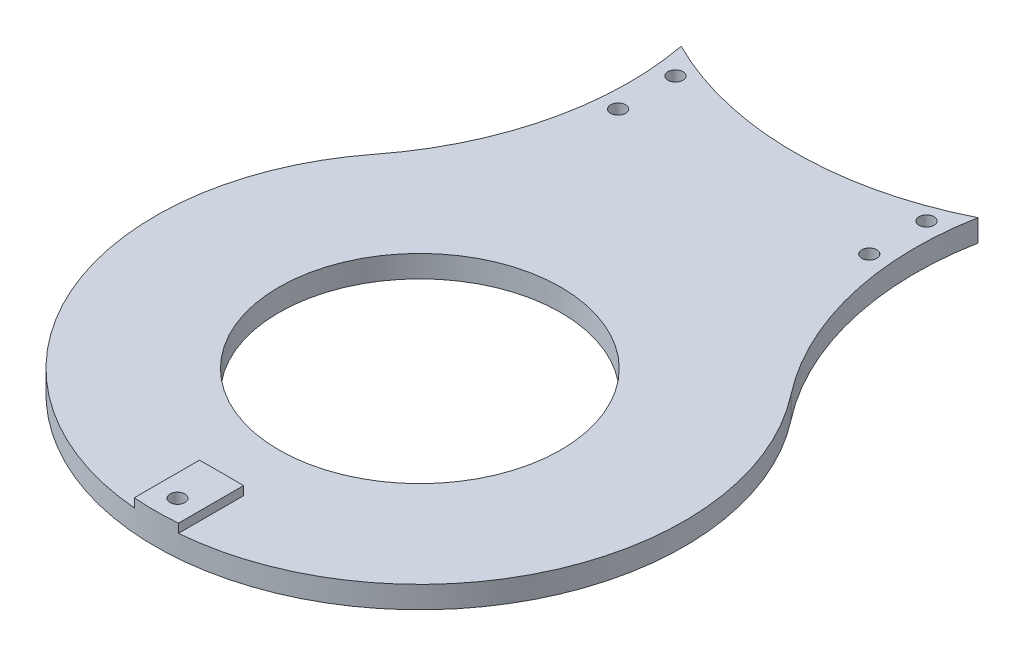
ISO-10303-21;
HEADER;
FILE_DESCRIPTION(('STEP AP214'),'2;1');
FILE_NAME('part.step','',(''),(''),'','','');
FILE_SCHEMA(('AUTOMOTIVE_DESIGN { 1 0 10303 214 1 1 1 1 }'));
ENDSEC;
DATA;
#1=APPLICATION_CONTEXT('core data for automotive mechanical design processes');
#2=APPLICATION_PROTOCOL_DEFINITION('international standard','automotive_design',2000,#1);
#3=PRODUCT_CONTEXT('',#1,'mechanical');
#4=PRODUCT('Part','Part','',(#3));
#5=PRODUCT_RELATED_PRODUCT_CATEGORY('part','',(#4));
#6=PRODUCT_DEFINITION_FORMATION('','',#4);
#7=PRODUCT_DEFINITION_CONTEXT('part definition',#1,'design');
#8=PRODUCT_DEFINITION('design','',#6,#7);
#9=PRODUCT_DEFINITION_SHAPE('','',#8);
#10=(LENGTH_UNIT() NAMED_UNIT(*) SI_UNIT(.MILLI.,.METRE.));
#11=(NAMED_UNIT(*) PLANE_ANGLE_UNIT() SI_UNIT($,.RADIAN.));
#12=(NAMED_UNIT(*) SI_UNIT($,.STERADIAN.) SOLID_ANGLE_UNIT());
#13=UNCERTAINTY_MEASURE_WITH_UNIT(LENGTH_MEASURE(1.E-05),#10,'distance_accuracy_value','');
#14=(GEOMETRIC_REPRESENTATION_CONTEXT(3) GLOBAL_UNCERTAINTY_ASSIGNED_CONTEXT((#13)) GLOBAL_UNIT_ASSIGNED_CONTEXT((#10,
#11,#12)) REPRESENTATION_CONTEXT('',''));
#15=CARTESIAN_POINT('',(0.,0.,0.));
#16=DIRECTION('',(0.,0.,1.));
#17=DIRECTION('',(1.,0.,0.));
#18=AXIS2_PLACEMENT_3D('',#15,#16,#17);
#19=CARTESIAN_POINT('',(0.,-12.,55.));
#20=DIRECTION('',(0.,1.,0.));
#21=DIRECTION('',(0.,0.,1.));
#22=AXIS2_PLACEMENT_3D('',#19,#20,#21);
#23=CYLINDRICAL_SURFACE('',#22,1.7);
#24=CARTESIAN_POINT('',(0.,7.,55.));
#25=DIRECTION('',(0.,1.,0.));
#26=DIRECTION('',(0.,0.,1.));
#27=AXIS2_PLACEMENT_3D('',#24,#25,#26);
#28=CIRCLE('',#27,1.7);
#29=CARTESIAN_POINT('',(0.,7.,56.7));
#30=VERTEX_POINT('',#29);
#31=EDGE_CURVE('E138',#30,#30,#28,.T.);
#32=ORIENTED_EDGE('',*,*,#31,.T.);
#33=EDGE_LOOP('',(#32));
#34=FACE_BOUND('',#33,.T.);
#35=CARTESIAN_POINT('',(0.,3.,55.));
#36=DIRECTION('',(0.,-1.,0.));
#37=DIRECTION('',(0.,0.,-1.));
#38=AXIS2_PLACEMENT_3D('',#35,#36,#37);
#39=CIRCLE('',#38,1.7);
#40=CARTESIAN_POINT('',(0.,3.,53.3));
#41=VERTEX_POINT('',#40);
#42=EDGE_CURVE('E136',#41,#41,#39,.F.);
#43=ORIENTED_EDGE('',*,*,#42,.F.);
#44=EDGE_LOOP('',(#43));
#45=FACE_BOUND('',#44,.T.);
#46=ADVANCED_FACE('F36',(#34,#45),#23,.F.);
#47=CARTESIAN_POINT('',(51.234753829798,5.,-40.));
#48=DIRECTION('',(0.,1.,0.));
#49=DIRECTION('',(0.,0.,1.));
#50=AXIS2_PLACEMENT_3D('',#47,#48,#49);
#51=PLANE('',#50);
#52=CARTESIAN_POINT('',(0.,5.,-160.));
#53=DIRECTION('',(0.,1.,0.));
#54=DIRECTION('',(0.,0.,1.));
#55=AXIS2_PLACEMENT_3D('',#52,#53,#54);
#56=CIRCLE('',#55,75.);
#57=CARTESIAN_POINT('',(-33.6854203746086,5.,-92.9903555136583));
#58=VERTEX_POINT('',#57);
#59=CARTESIAN_POINT('',(33.6854203746086,5.,-92.9903555136583));
#60=VERTEX_POINT('',#59);
#61=EDGE_CURVE('E102',#58,#60,#56,.T.);
#62=ORIENTED_EDGE('',*,*,#61,.F.);
#63=CARTESIAN_POINT('',(-102.469507659596,5.,-80.));
#64=DIRECTION('',(0.,-1.,0.));
#65=DIRECTION('',(0.,0.,1.));
#66=AXIS2_PLACEMENT_3D('',#63,#64,#65);
#67=CIRCLE('',#66,70.);
#68=CARTESIAN_POINT('',(-47.2936189198135,5.,-36.9230769230769));
#69=VERTEX_POINT('',#68);
#70=EDGE_CURVE('E185',#58,#69,#67,.T.);
#71=ORIENTED_EDGE('',*,*,#70,.T.);
#72=CARTESIAN_POINT('',(0.,5.,0.));
#73=DIRECTION('',(0.,1.,0.));
#74=DIRECTION('',(0.,0.,1.));
#75=AXIS2_PLACEMENT_3D('',#72,#73,#74);
#76=CIRCLE('',#75,60.);
#77=CARTESIAN_POINT('',(-5.00000000000001,5.,59.791303715507));
#78=VERTEX_POINT('',#77);
#79=EDGE_CURVE('E129',#69,#78,#76,.T.);
#80=ORIENTED_EDGE('',*,*,#79,.T.);
#81=DIRECTION('',(0.,0.,1.));
#82=VECTOR('',#81,1.);
#83=CARTESIAN_POINT('',(-5.00000000000001,5.,45.));
#84=LINE('',#83,#82);
#85=CARTESIAN_POINT('',(-5.00000000000001,5.,45.));
#86=VERTEX_POINT('',#85);
#87=EDGE_CURVE('E143',#86,#78,#84,.T.);
#88=ORIENTED_EDGE('',*,*,#87,.F.);
#89=DIRECTION('',(-1.,0.,0.));
#90=VECTOR('',#89,1.);
#91=CARTESIAN_POINT('',(-5.00000000000001,5.,45.));
#92=LINE('',#91,#90);
#93=CARTESIAN_POINT('',(4.99999999999999,5.,45.));
#94=VERTEX_POINT('',#93);
#95=EDGE_CURVE('E58',#94,#86,#92,.T.);
#96=ORIENTED_EDGE('',*,*,#95,.F.);
#97=DIRECTION('',(0.,0.,-1.));
#98=VECTOR('',#97,1.);
#99=CARTESIAN_POINT('',(4.99999999999999,5.,45.));
#100=LINE('',#99,#98);
#101=CARTESIAN_POINT('',(4.99999999999999,5.,59.791303715507));
#102=VERTEX_POINT('',#101);
#103=EDGE_CURVE('E169',#102,#94,#100,.T.);
#104=ORIENTED_EDGE('',*,*,#103,.F.);
#105=CARTESIAN_POINT('',(47.2936189198135,5.,-36.9230769230769));
#106=VERTEX_POINT('',#105);
#107=EDGE_CURVE('E186',#102,#106,#76,.T.);
#108=ORIENTED_EDGE('',*,*,#107,.T.);
#109=CARTESIAN_POINT('',(102.469507659596,5.,-80.));
#110=DIRECTION('',(0.,-1.,0.));
#111=DIRECTION('',(0.,0.,1.));
#112=AXIS2_PLACEMENT_3D('',#109,#110,#111);
#113=CIRCLE('',#112,70.);
#114=EDGE_CURVE('E133',#106,#60,#113,.T.);
#115=ORIENTED_EDGE('',*,*,#114,.T.);
#116=EDGE_LOOP('',(#62,#71,#80,#88,#96,#104,#108,#115));
#117=FACE_BOUND('',#116,.T.);
#118=CARTESIAN_POINT('',(28.5,5.,-73.5));
#119=DIRECTION('',(0.,-1.,0.));
#120=DIRECTION('',(0.,0.,-1.));
#121=AXIS2_PLACEMENT_3D('',#118,#119,#120);
#122=CIRCLE('',#121,1.70000000000001);
#123=CARTESIAN_POINT('',(28.5,5.,-75.2));
#124=VERTEX_POINT('',#123);
#125=EDGE_CURVE('E400',#124,#124,#122,.T.);
#126=ORIENTED_EDGE('',*,*,#125,.T.);
#127=EDGE_LOOP('',(#126));
#128=FACE_BOUND('',#127,.T.);
#129=CARTESIAN_POINT('',(28.5,5.,-86.5));
#130=DIRECTION('',(0.,-1.,0.));
#131=DIRECTION('',(0.,0.,-1.));
#132=AXIS2_PLACEMENT_3D('',#129,#130,#131);
#133=CIRCLE('',#132,1.70000000000001);
#134=CARTESIAN_POINT('',(28.5,5.,-88.2));
#135=VERTEX_POINT('',#134);
#136=EDGE_CURVE('E393',#135,#135,#133,.T.);
#137=ORIENTED_EDGE('',*,*,#136,.T.);
#138=EDGE_LOOP('',(#137));
#139=FACE_BOUND('',#138,.T.);
#140=CARTESIAN_POINT('',(-28.5,5.,-86.5));
#141=DIRECTION('',(0.,-1.,0.));
#142=DIRECTION('',(0.,0.,-1.));
#143=AXIS2_PLACEMENT_3D('',#140,#141,#142);
#144=CIRCLE('',#143,1.70000000000001);
#145=CARTESIAN_POINT('',(-28.5,5.,-88.2));
#146=VERTEX_POINT('',#145);
#147=EDGE_CURVE('E392',#146,#146,#144,.T.);
#148=ORIENTED_EDGE('',*,*,#147,.T.);
#149=EDGE_LOOP('',(#148));
#150=FACE_BOUND('',#149,.T.);
#151=CARTESIAN_POINT('',(-28.5,5.,-73.5));
#152=DIRECTION('',(0.,-1.,0.));
#153=DIRECTION('',(0.,0.,-1.));
#154=AXIS2_PLACEMENT_3D('',#151,#152,#153);
#155=CIRCLE('',#154,1.70000000000001);
#156=CARTESIAN_POINT('',(-28.5,5.,-75.2));
#157=VERTEX_POINT('',#156);
#158=EDGE_CURVE('E151',#157,#157,#155,.T.);
#159=ORIENTED_EDGE('',*,*,#158,.T.);
#160=EDGE_LOOP('',(#159));
#161=FACE_BOUND('',#160,.T.);
#162=CARTESIAN_POINT('',(0.,5.,0.));
#163=DIRECTION('',(0.,1.,0.));
#164=DIRECTION('',(0.,0.,1.));
#165=AXIS2_PLACEMENT_3D('',#162,#163,#164);
#166=CIRCLE('',#165,32.);
#167=CARTESIAN_POINT('',(0.,5.,32.));
#168=VERTEX_POINT('',#167);
#169=EDGE_CURVE('E121',#168,#168,#166,.T.);
#170=ORIENTED_EDGE('',*,*,#169,.F.);
#171=EDGE_LOOP('',(#170));
#172=FACE_BOUND('',#171,.T.);
#173=ADVANCED_FACE('F190',(#117,#128,#139,#150,#161,#172),#51,.T.);
#174=CARTESIAN_POINT('',(51.234753829798,0.,-40.));
#175=DIRECTION('',(0.,1.,0.));
#176=DIRECTION('',(0.,0.,1.));
#177=AXIS2_PLACEMENT_3D('',#174,#175,#176);
#178=PLANE('',#177);
#179=CARTESIAN_POINT('',(28.5,0.,-73.5));
#180=DIRECTION('',(0.,-1.,0.));
#181=DIRECTION('',(0.,0.,-1.));
#182=AXIS2_PLACEMENT_3D('',#179,#180,#181);
#183=CIRCLE('',#182,1.70000000000001);
#184=CARTESIAN_POINT('',(28.5,0.,-75.2));
#185=VERTEX_POINT('',#184);
#186=EDGE_CURVE('E107',#185,#185,#183,.T.);
#187=ORIENTED_EDGE('',*,*,#186,.F.);
#188=EDGE_LOOP('',(#187));
#189=FACE_BOUND('',#188,.T.);
#190=CARTESIAN_POINT('',(28.5,0.,-86.5));
#191=DIRECTION('',(0.,-1.,0.));
#192=DIRECTION('',(0.,0.,-1.));
#193=AXIS2_PLACEMENT_3D('',#190,#191,#192);
#194=CIRCLE('',#193,1.70000000000001);
#195=CARTESIAN_POINT('',(28.5,0.,-88.2));
#196=VERTEX_POINT('',#195);
#197=EDGE_CURVE('E253',#196,#196,#194,.T.);
#198=ORIENTED_EDGE('',*,*,#197,.F.);
#199=EDGE_LOOP('',(#198));
#200=FACE_BOUND('',#199,.T.);
#201=CARTESIAN_POINT('',(-28.5,0.,-86.5));
#202=DIRECTION('',(0.,-1.,0.));
#203=DIRECTION('',(0.,0.,-1.));
#204=AXIS2_PLACEMENT_3D('',#201,#202,#203);
#205=CIRCLE('',#204,1.70000000000001);
#206=CARTESIAN_POINT('',(-28.5,0.,-88.2));
#207=VERTEX_POINT('',#206);
#208=EDGE_CURVE('E257',#207,#207,#205,.T.);
#209=ORIENTED_EDGE('',*,*,#208,.F.);
#210=EDGE_LOOP('',(#209));
#211=FACE_BOUND('',#210,.T.);
#212=CARTESIAN_POINT('',(-28.5,0.,-73.5));
#213=DIRECTION('',(0.,-1.,0.));
#214=DIRECTION('',(0.,0.,-1.));
#215=AXIS2_PLACEMENT_3D('',#212,#213,#214);
#216=CIRCLE('',#215,1.70000000000001);
#217=CARTESIAN_POINT('',(-28.5,0.,-75.2));
#218=VERTEX_POINT('',#217);
#219=EDGE_CURVE('E154',#218,#218,#216,.T.);
#220=ORIENTED_EDGE('',*,*,#219,.F.);
#221=EDGE_LOOP('',(#220));
#222=FACE_BOUND('',#221,.T.);
#223=CARTESIAN_POINT('',(0.,0.,55.));
#224=DIRECTION('',(0.,-1.,0.));
#225=DIRECTION('',(0.,0.,-1.));
#226=AXIS2_PLACEMENT_3D('',#223,#224,#225);
#227=CIRCLE('',#226,2.95);
#228=CARTESIAN_POINT('',(0.,0.,52.05));
#229=VERTEX_POINT('',#228);
#230=EDGE_CURVE('E146',#229,#229,#227,.T.);
#231=ORIENTED_EDGE('',*,*,#230,.F.);
#232=EDGE_LOOP('',(#231));
#233=FACE_BOUND('',#232,.T.);
#234=CARTESIAN_POINT('',(-102.469507659596,0.,-80.));
#235=DIRECTION('',(0.,-1.,0.));
#236=DIRECTION('',(0.,0.,1.));
#237=AXIS2_PLACEMENT_3D('',#234,#235,#236);
#238=CIRCLE('',#237,70.);
#239=CARTESIAN_POINT('',(-33.6854203746086,0.,-92.9903555136583));
#240=VERTEX_POINT('',#239);
#241=CARTESIAN_POINT('',(-47.2936189198135,0.,-36.9230769230769));
#242=VERTEX_POINT('',#241);
#243=EDGE_CURVE('E116',#240,#242,#238,.T.);
#244=ORIENTED_EDGE('',*,*,#243,.F.);
#245=CARTESIAN_POINT('',(0.,0.,-160.));
#246=DIRECTION('',(0.,-1.,0.));
#247=DIRECTION('',(0.,0.,-1.));
#248=AXIS2_PLACEMENT_3D('',#245,#246,#247);
#249=CIRCLE('',#248,75.);
#250=CARTESIAN_POINT('',(33.6854203746086,0.,-92.9903555136583));
#251=VERTEX_POINT('',#250);
#252=EDGE_CURVE('E51',#251,#240,#249,.T.);
#253=ORIENTED_EDGE('',*,*,#252,.F.);
#254=CARTESIAN_POINT('',(102.469507659596,0.,-80.));
#255=DIRECTION('',(0.,-1.,0.));
#256=DIRECTION('',(0.,0.,1.));
#257=AXIS2_PLACEMENT_3D('',#254,#255,#256);
#258=CIRCLE('',#257,70.);
#259=CARTESIAN_POINT('',(47.2936189198135,0.,-36.9230769230769));
#260=VERTEX_POINT('',#259);
#261=EDGE_CURVE('E115',#260,#251,#258,.T.);
#262=ORIENTED_EDGE('',*,*,#261,.F.);
#263=CARTESIAN_POINT('',(0.,0.,0.));
#264=DIRECTION('',(0.,1.,0.));
#265=DIRECTION('',(0.,0.,1.));
#266=AXIS2_PLACEMENT_3D('',#263,#264,#265);
#267=CIRCLE('',#266,60.);
#268=EDGE_CURVE('E123',#242,#260,#267,.T.);
#269=ORIENTED_EDGE('',*,*,#268,.F.);
#270=EDGE_LOOP('',(#244,#253,#262,#269));
#271=FACE_BOUND('',#270,.T.);
#272=CARTESIAN_POINT('',(0.,0.,0.));
#273=DIRECTION('',(0.,1.,0.));
#274=DIRECTION('',(0.,0.,1.));
#275=AXIS2_PLACEMENT_3D('',#272,#273,#274);
#276=CIRCLE('',#275,32.);
#277=CARTESIAN_POINT('',(0.,0.,32.));
#278=VERTEX_POINT('',#277);
#279=EDGE_CURVE('E126',#278,#278,#276,.T.);
#280=ORIENTED_EDGE('',*,*,#279,.T.);
#281=EDGE_LOOP('',(#280));
#282=FACE_BOUND('',#281,.T.);
#283=ADVANCED_FACE('F112',(#189,#200,#211,#222,#233,#271,#282),#178,.F.);
#284=CARTESIAN_POINT('',(102.469507659596,5.,-80.));
#285=DIRECTION('',(0.,-1.,0.));
#286=DIRECTION('',(0.,0.,-1.));
#287=AXIS2_PLACEMENT_3D('',#284,#285,#286);
#288=CYLINDRICAL_SURFACE('',#287,70.);
#289=ORIENTED_EDGE('',*,*,#261,.T.);
#290=DIRECTION('',(0.,-1.,0.));
#291=VECTOR('',#290,1.);
#292=CARTESIAN_POINT('',(33.6854203746086,18.5,-92.9903555136583));
#293=LINE('',#292,#291);
#294=EDGE_CURVE('E99',#251,#60,#293,.F.);
#295=ORIENTED_EDGE('',*,*,#294,.T.);
#296=ORIENTED_EDGE('',*,*,#114,.F.);
#297=DIRECTION('',(0.,-1.,0.));
#298=VECTOR('',#297,1.);
#299=CARTESIAN_POINT('',(47.2936189198135,5.,-36.9230769230769));
#300=LINE('',#299,#298);
#301=EDGE_CURVE('E120',#106,#260,#300,.T.);
#302=ORIENTED_EDGE('',*,*,#301,.T.);
#303=EDGE_LOOP('',(#289,#295,#296,#302));
#304=FACE_BOUND('',#303,.T.);
#305=ADVANCED_FACE('F38',(#304),#288,.F.);
#306=CARTESIAN_POINT('',(-102.469507659596,5.,-80.));
#307=DIRECTION('',(0.,-1.,0.));
#308=DIRECTION('',(0.,0.,-1.));
#309=AXIS2_PLACEMENT_3D('',#306,#307,#308);
#310=CYLINDRICAL_SURFACE('',#309,70.);
#311=ORIENTED_EDGE('',*,*,#70,.F.);
#312=DIRECTION('',(0.,-1.,0.));
#313=VECTOR('',#312,1.);
#314=CARTESIAN_POINT('',(-33.6854203746086,18.5,-92.9903555136583));
#315=LINE('',#314,#313);
#316=EDGE_CURVE('E11',#58,#240,#315,.T.);
#317=ORIENTED_EDGE('',*,*,#316,.T.);
#318=ORIENTED_EDGE('',*,*,#243,.T.);
#319=DIRECTION('',(0.,-1.,0.));
#320=VECTOR('',#319,1.);
#321=CARTESIAN_POINT('',(-47.2936189198135,5.,-36.9230769230769));
#322=LINE('',#321,#320);
#323=EDGE_CURVE('E44',#69,#242,#322,.T.);
#324=ORIENTED_EDGE('',*,*,#323,.F.);
#325=EDGE_LOOP('',(#311,#317,#318,#324));
#326=FACE_BOUND('',#325,.T.);
#327=ADVANCED_FACE('F209',(#326),#310,.F.);
#328=CARTESIAN_POINT('',(0.,5.,0.));
#329=DIRECTION('',(0.,-1.,0.));
#330=DIRECTION('',(0.,0.,-1.));
#331=AXIS2_PLACEMENT_3D('',#328,#329,#330);
#332=CYLINDRICAL_SURFACE('',#331,60.);
#333=ORIENTED_EDGE('',*,*,#268,.T.);
#334=ORIENTED_EDGE('',*,*,#301,.F.);
#335=ORIENTED_EDGE('',*,*,#107,.F.);
#336=DIRECTION('',(0.,-1.,0.));
#337=VECTOR('',#336,1.);
#338=CARTESIAN_POINT('',(4.99999999999999,7.,59.791303715507));
#339=LINE('',#338,#337);
#340=CARTESIAN_POINT('',(4.99999999999999,7.,59.791303715507));
#341=VERTEX_POINT('',#340);
#342=EDGE_CURVE('E177',#341,#102,#339,.T.);
#343=ORIENTED_EDGE('',*,*,#342,.F.);
#344=CARTESIAN_POINT('',(0.,7.,0.));
#345=DIRECTION('',(0.,1.,0.));
#346=DIRECTION('',(0.,0.,1.));
#347=AXIS2_PLACEMENT_3D('',#344,#345,#346);
#348=CIRCLE('',#347,60.);
#349=CARTESIAN_POINT('',(-5.00000000000004,7.,59.791303715507));
#350=VERTEX_POINT('',#349);
#351=EDGE_CURVE('E160',#350,#341,#348,.T.);
#352=ORIENTED_EDGE('',*,*,#351,.F.);
#353=DIRECTION('',(0.,-1.,0.));
#354=VECTOR('',#353,1.);
#355=CARTESIAN_POINT('',(-5.00000000000004,7.,59.791303715507));
#356=LINE('',#355,#354);
#357=EDGE_CURVE('E180',#350,#78,#356,.T.);
#358=ORIENTED_EDGE('',*,*,#357,.T.);
#359=ORIENTED_EDGE('',*,*,#79,.F.);
#360=ORIENTED_EDGE('',*,*,#323,.T.);
#361=EDGE_LOOP('',(#333,#334,#335,#343,#352,#358,#359,#360));
#362=FACE_BOUND('',#361,.T.);
#363=ADVANCED_FACE('F194',(#362),#332,.T.);
#364=CARTESIAN_POINT('',(0.,5.,0.));
#365=DIRECTION('',(0.,-1.,0.));
#366=DIRECTION('',(0.,0.,-1.));
#367=AXIS2_PLACEMENT_3D('',#364,#365,#366);
#368=CYLINDRICAL_SURFACE('',#367,32.);
#369=ORIENTED_EDGE('',*,*,#169,.T.);
#370=EDGE_LOOP('',(#369));
#371=FACE_BOUND('',#370,.T.);
#372=ORIENTED_EDGE('',*,*,#279,.F.);
#373=EDGE_LOOP('',(#372));
#374=FACE_BOUND('',#373,.T.);
#375=ADVANCED_FACE('F215',(#371,#374),#368,.F.);
#376=CARTESIAN_POINT('',(-5.00000000000001,7.,45.));
#377=DIRECTION('',(1.,0.,0.));
#378=DIRECTION('',(0.,0.,-1.));
#379=AXIS2_PLACEMENT_3D('',#376,#377,#378);
#380=PLANE('',#379);
#381=ORIENTED_EDGE('',*,*,#87,.T.);
#382=ORIENTED_EDGE('',*,*,#357,.F.);
#383=DIRECTION('',(0.,0.,1.));
#384=VECTOR('',#383,1.);
#385=CARTESIAN_POINT('',(-5.00000000000001,7.,45.));
#386=LINE('',#385,#384);
#387=CARTESIAN_POINT('',(-5.00000000000001,7.,45.));
#388=VERTEX_POINT('',#387);
#389=EDGE_CURVE('E157',#388,#350,#386,.T.);
#390=ORIENTED_EDGE('',*,*,#389,.F.);
#391=DIRECTION('',(0.,-1.,0.));
#392=VECTOR('',#391,1.);
#393=CARTESIAN_POINT('',(-5.00000000000001,7.,45.));
#394=LINE('',#393,#392);
#395=EDGE_CURVE('E166',#388,#86,#394,.T.);
#396=ORIENTED_EDGE('',*,*,#395,.T.);
#397=EDGE_LOOP('',(#381,#382,#390,#396));
#398=FACE_BOUND('',#397,.T.);
#399=ADVANCED_FACE('F198',(#398),#380,.F.);
#400=CARTESIAN_POINT('',(4.99999999999999,7.,45.));
#401=DIRECTION('',(-1.,0.,0.));
#402=DIRECTION('',(0.,0.,1.));
#403=AXIS2_PLACEMENT_3D('',#400,#401,#402);
#404=PLANE('',#403);
#405=ORIENTED_EDGE('',*,*,#103,.T.);
#406=DIRECTION('',(0.,-1.,0.));
#407=VECTOR('',#406,1.);
#408=CARTESIAN_POINT('',(4.99999999999999,7.,45.));
#409=LINE('',#408,#407);
#410=CARTESIAN_POINT('',(4.99999999999999,7.,45.));
#411=VERTEX_POINT('',#410);
#412=EDGE_CURVE('E174',#411,#94,#409,.T.);
#413=ORIENTED_EDGE('',*,*,#412,.F.);
#414=DIRECTION('',(0.,0.,-1.));
#415=VECTOR('',#414,1.);
#416=CARTESIAN_POINT('',(4.99999999999999,7.,45.));
#417=LINE('',#416,#415);
#418=EDGE_CURVE('E162',#341,#411,#417,.T.);
#419=ORIENTED_EDGE('',*,*,#418,.F.);
#420=ORIENTED_EDGE('',*,*,#342,.T.);
#421=EDGE_LOOP('',(#405,#413,#419,#420));
#422=FACE_BOUND('',#421,.T.);
#423=ADVANCED_FACE('F206',(#422),#404,.F.);
#424=CARTESIAN_POINT('',(-5.00000000000001,7.,45.));
#425=DIRECTION('',(0.,0.,1.));
#426=DIRECTION('',(1.,0.,0.));
#427=AXIS2_PLACEMENT_3D('',#424,#425,#426);
#428=PLANE('',#427);
#429=ORIENTED_EDGE('',*,*,#95,.T.);
#430=ORIENTED_EDGE('',*,*,#395,.F.);
#431=DIRECTION('',(-1.,0.,0.));
#432=VECTOR('',#431,1.);
#433=CARTESIAN_POINT('',(-5.00000000000001,7.,45.));
#434=LINE('',#433,#432);
#435=EDGE_CURVE('E164',#411,#388,#434,.T.);
#436=ORIENTED_EDGE('',*,*,#435,.F.);
#437=ORIENTED_EDGE('',*,*,#412,.T.);
#438=EDGE_LOOP('',(#429,#430,#436,#437));
#439=FACE_BOUND('',#438,.T.);
#440=ADVANCED_FACE('F202',(#439),#428,.F.);
#441=CARTESIAN_POINT('',(0.,7.,0.));
#442=DIRECTION('',(0.,1.,0.));
#443=DIRECTION('',(0.,0.,1.));
#444=AXIS2_PLACEMENT_3D('',#441,#442,#443);
#445=PLANE('',#444);
#446=ORIENTED_EDGE('',*,*,#31,.F.);
#447=EDGE_LOOP('',(#446));
#448=FACE_BOUND('',#447,.T.);
#449=ORIENTED_EDGE('',*,*,#389,.T.);
#450=ORIENTED_EDGE('',*,*,#351,.T.);
#451=ORIENTED_EDGE('',*,*,#418,.T.);
#452=ORIENTED_EDGE('',*,*,#435,.T.);
#453=EDGE_LOOP('',(#449,#450,#451,#452));
#454=FACE_BOUND('',#453,.T.);
#455=ADVANCED_FACE('F229',(#448,#454),#445,.T.);
#456=CARTESIAN_POINT('',(0.,3.,55.));
#457=DIRECTION('',(0.,-1.,0.));
#458=DIRECTION('',(0.,0.,-1.));
#459=AXIS2_PLACEMENT_3D('',#456,#457,#458);
#460=PLANE('',#459);
#461=CARTESIAN_POINT('',(0.,3.,55.));
#462=DIRECTION('',(0.,-1.,0.));
#463=DIRECTION('',(0.,0.,-1.));
#464=AXIS2_PLACEMENT_3D('',#461,#462,#463);
#465=CIRCLE('',#464,2.95);
#466=CARTESIAN_POINT('',(0.,3.,52.05));
#467=VERTEX_POINT('',#466);
#468=EDGE_CURVE('E139',#467,#467,#465,.T.);
#469=ORIENTED_EDGE('',*,*,#468,.T.);
#470=EDGE_LOOP('',(#469));
#471=FACE_BOUND('',#470,.T.);
#472=ORIENTED_EDGE('',*,*,#42,.T.);
#473=EDGE_LOOP('',(#472));
#474=FACE_BOUND('',#473,.T.);
#475=ADVANCED_FACE('F232',(#471,#474),#460,.T.);
#476=CARTESIAN_POINT('',(0.,3.,55.));
#477=DIRECTION('',(0.,-1.,0.));
#478=DIRECTION('',(0.,0.,-1.));
#479=AXIS2_PLACEMENT_3D('',#476,#477,#478);
#480=CYLINDRICAL_SURFACE('',#479,2.95);
#481=ORIENTED_EDGE('',*,*,#468,.F.);
#482=EDGE_LOOP('',(#481));
#483=FACE_BOUND('',#482,.T.);
#484=ORIENTED_EDGE('',*,*,#230,.T.);
#485=EDGE_LOOP('',(#484));
#486=FACE_BOUND('',#485,.T.);
#487=ADVANCED_FACE('F227',(#483,#486),#480,.F.);
#488=CARTESIAN_POINT('',(-28.5,5.,-73.5));
#489=DIRECTION('',(0.,-1.,0.));
#490=DIRECTION('',(0.,0.,-1.));
#491=AXIS2_PLACEMENT_3D('',#488,#489,#490);
#492=CYLINDRICAL_SURFACE('',#491,1.70000000000001);
#493=ORIENTED_EDGE('',*,*,#158,.F.);
#494=EDGE_LOOP('',(#493));
#495=FACE_BOUND('',#494,.T.);
#496=ORIENTED_EDGE('',*,*,#219,.T.);
#497=EDGE_LOOP('',(#496));
#498=FACE_BOUND('',#497,.T.);
#499=ADVANCED_FACE('F264',(#495,#498),#492,.F.);
#500=CARTESIAN_POINT('',(-28.5,5.,-86.5));
#501=DIRECTION('',(0.,-1.,0.));
#502=DIRECTION('',(0.,0.,-1.));
#503=AXIS2_PLACEMENT_3D('',#500,#501,#502);
#504=CYLINDRICAL_SURFACE('',#503,1.70000000000001);
#505=ORIENTED_EDGE('',*,*,#147,.F.);
#506=EDGE_LOOP('',(#505));
#507=FACE_BOUND('',#506,.T.);
#508=ORIENTED_EDGE('',*,*,#208,.T.);
#509=EDGE_LOOP('',(#508));
#510=FACE_BOUND('',#509,.T.);
#511=ADVANCED_FACE('F270',(#507,#510),#504,.F.);
#512=CARTESIAN_POINT('',(28.5,5.,-86.5));
#513=DIRECTION('',(0.,-1.,0.));
#514=DIRECTION('',(0.,0.,-1.));
#515=AXIS2_PLACEMENT_3D('',#512,#513,#514);
#516=CYLINDRICAL_SURFACE('',#515,1.70000000000001);
#517=ORIENTED_EDGE('',*,*,#136,.F.);
#518=EDGE_LOOP('',(#517));
#519=FACE_BOUND('',#518,.T.);
#520=ORIENTED_EDGE('',*,*,#197,.T.);
#521=EDGE_LOOP('',(#520));
#522=FACE_BOUND('',#521,.T.);
#523=ADVANCED_FACE('F279',(#519,#522),#516,.F.);
#524=CARTESIAN_POINT('',(28.5,5.,-73.5));
#525=DIRECTION('',(0.,-1.,0.));
#526=DIRECTION('',(0.,0.,-1.));
#527=AXIS2_PLACEMENT_3D('',#524,#525,#526);
#528=CYLINDRICAL_SURFACE('',#527,1.70000000000001);
#529=ORIENTED_EDGE('',*,*,#125,.F.);
#530=EDGE_LOOP('',(#529));
#531=FACE_BOUND('',#530,.T.);
#532=ORIENTED_EDGE('',*,*,#186,.T.);
#533=EDGE_LOOP('',(#532));
#534=FACE_BOUND('',#533,.T.);
#535=ADVANCED_FACE('F276',(#531,#534),#528,.F.);
#536=CARTESIAN_POINT('',(0.,37.,-160.));
#537=DIRECTION('',(0.,-1.,0.));
#538=DIRECTION('',(0.,0.,-1.));
#539=AXIS2_PLACEMENT_3D('',#536,#537,#538);
#540=CYLINDRICAL_SURFACE('',#539,75.);
#541=ORIENTED_EDGE('',*,*,#252,.T.);
#542=ORIENTED_EDGE('',*,*,#316,.F.);
#543=ORIENTED_EDGE('',*,*,#61,.T.);
#544=ORIENTED_EDGE('',*,*,#294,.F.);
#545=EDGE_LOOP('',(#541,#542,#543,#544));
#546=FACE_BOUND('',#545,.T.);
#547=ADVANCED_FACE('F100',(#546),#540,.F.);
#548=CLOSED_SHELL('',(#46,#173,#283,#305,#327,#363,#375,#399,#423,#440,#455,#475,#487,#499,#511,
#523,#535,#547));
#549=MANIFOLD_SOLID_BREP('B2',#548);
#550=ADVANCED_BREP_SHAPE_REPRESENTATION('',(#18,#549),#14);
#551=SHAPE_DEFINITION_REPRESENTATION(#9,#550);
ENDSEC;
END-ISO-10303-21;
